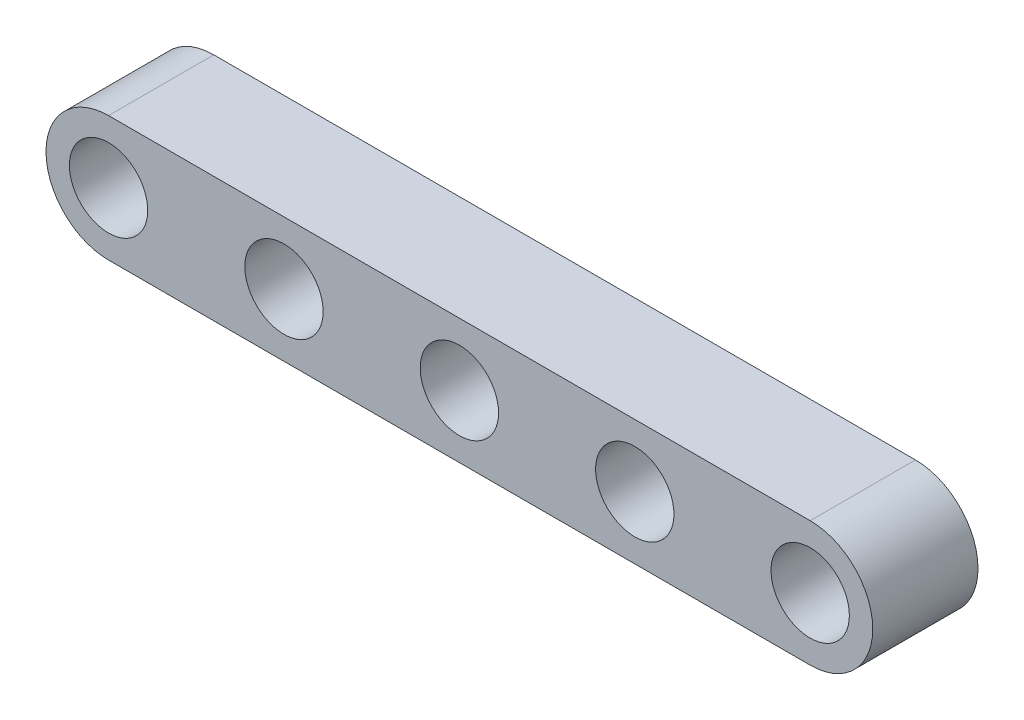
ISO-10303-21;
HEADER;
FILE_DESCRIPTION(('STEP AP214'),'2;1');
FILE_NAME('part.step','',(''),(''),'','','');
FILE_SCHEMA(('AUTOMOTIVE_DESIGN { 1 0 10303 214 1 1 1 1 }'));
ENDSEC;
DATA;
#1=APPLICATION_CONTEXT('core data for automotive mechanical design processes');
#2=APPLICATION_PROTOCOL_DEFINITION('international standard','automotive_design',2000,#1);
#3=PRODUCT_CONTEXT('',#1,'mechanical');
#4=PRODUCT('Part','Part','',(#3));
#5=PRODUCT_RELATED_PRODUCT_CATEGORY('part','',(#4));
#6=PRODUCT_DEFINITION_FORMATION('','',#4);
#7=PRODUCT_DEFINITION_CONTEXT('part definition',#1,'design');
#8=PRODUCT_DEFINITION('design','',#6,#7);
#9=PRODUCT_DEFINITION_SHAPE('','',#8);
#10=(LENGTH_UNIT() NAMED_UNIT(*) SI_UNIT(.MILLI.,.METRE.));
#11=(NAMED_UNIT(*) PLANE_ANGLE_UNIT() SI_UNIT($,.RADIAN.));
#12=(NAMED_UNIT(*) SI_UNIT($,.STERADIAN.) SOLID_ANGLE_UNIT());
#13=UNCERTAINTY_MEASURE_WITH_UNIT(LENGTH_MEASURE(1.E-05),#10,'distance_accuracy_value','');
#14=(GEOMETRIC_REPRESENTATION_CONTEXT(3) GLOBAL_UNCERTAINTY_ASSIGNED_CONTEXT((#13)) GLOBAL_UNIT_ASSIGNED_CONTEXT((#10,
#11,#12)) REPRESENTATION_CONTEXT('',''));
#15=CARTESIAN_POINT('',(0.,0.,0.));
#16=DIRECTION('',(0.,0.,1.));
#17=DIRECTION('',(1.,0.,0.));
#18=AXIS2_PLACEMENT_3D('',#15,#16,#17);
#19=CARTESIAN_POINT('',(-15.,0.,2.25));
#20=DIRECTION('',(0.,0.,1.));
#21=DIRECTION('',(1.,0.,0.));
#22=AXIS2_PLACEMENT_3D('',#19,#20,#21);
#23=PLANE('',#22);
#24=CARTESIAN_POINT('',(7.5,0.,2.25));
#25=DIRECTION('',(0.,0.,1.));
#26=DIRECTION('',(1.,0.,0.));
#27=AXIS2_PLACEMENT_3D('',#24,#25,#26);
#28=CIRCLE('',#27,1.675);
#29=CARTESIAN_POINT('',(9.175,0.,2.25));
#30=VERTEX_POINT('',#29);
#31=EDGE_CURVE('E150',#30,#30,#28,.T.);
#32=ORIENTED_EDGE('',*,*,#31,.F.);
#33=EDGE_LOOP('',(#32));
#34=FACE_BOUND('',#33,.T.);
#35=CARTESIAN_POINT('',(-7.5,0.,2.25));
#36=DIRECTION('',(0.,0.,1.));
#37=DIRECTION('',(1.,0.,0.));
#38=AXIS2_PLACEMENT_3D('',#35,#36,#37);
#39=CIRCLE('',#38,1.675);
#40=CARTESIAN_POINT('',(-5.825,0.,2.25));
#41=VERTEX_POINT('',#40);
#42=EDGE_CURVE('E134',#41,#41,#39,.T.);
#43=ORIENTED_EDGE('',*,*,#42,.F.);
#44=EDGE_LOOP('',(#43));
#45=FACE_BOUND('',#44,.T.);
#46=CARTESIAN_POINT('',(-15.,0.,2.25));
#47=DIRECTION('',(0.,0.,1.));
#48=DIRECTION('',(1.,0.,0.));
#49=AXIS2_PLACEMENT_3D('',#46,#47,#48);
#50=CIRCLE('',#49,2.675);
#51=CARTESIAN_POINT('',(-15.,2.675,2.25));
#52=VERTEX_POINT('',#51);
#53=CARTESIAN_POINT('',(-15.,-2.675,2.25));
#54=VERTEX_POINT('',#53);
#55=EDGE_CURVE('E92',#52,#54,#50,.T.);
#56=ORIENTED_EDGE('',*,*,#55,.T.);
#57=DIRECTION('',(1.,0.,0.));
#58=VECTOR('',#57,1.);
#59=CARTESIAN_POINT('',(-15.,-2.675,2.25));
#60=LINE('',#59,#58);
#61=CARTESIAN_POINT('',(15.,-2.675,2.25));
#62=VERTEX_POINT('',#61);
#63=EDGE_CURVE('E87',#54,#62,#60,.T.);
#64=ORIENTED_EDGE('',*,*,#63,.T.);
#65=CARTESIAN_POINT('',(15.,0.,2.25));
#66=DIRECTION('',(0.,0.,1.));
#67=DIRECTION('',(1.,0.,0.));
#68=AXIS2_PLACEMENT_3D('',#65,#66,#67);
#69=CIRCLE('',#68,2.675);
#70=CARTESIAN_POINT('',(15.,2.675,2.25));
#71=VERTEX_POINT('',#70);
#72=EDGE_CURVE('E90',#62,#71,#69,.T.);
#73=ORIENTED_EDGE('',*,*,#72,.T.);
#74=DIRECTION('',(-1.,0.,0.));
#75=VECTOR('',#74,1.);
#76=CARTESIAN_POINT('',(-15.,2.675,2.25));
#77=LINE('',#76,#75);
#78=EDGE_CURVE('E57',#71,#52,#77,.T.);
#79=ORIENTED_EDGE('',*,*,#78,.T.);
#80=EDGE_LOOP('',(#56,#64,#73,#79));
#81=FACE_BOUND('',#80,.T.);
#82=CARTESIAN_POINT('',(-15.,0.,2.25));
#83=DIRECTION('',(0.,0.,1.));
#84=DIRECTION('',(1.,0.,0.));
#85=AXIS2_PLACEMENT_3D('',#82,#83,#84);
#86=CIRCLE('',#85,1.675);
#87=CARTESIAN_POINT('',(-13.325,0.,2.25));
#88=VERTEX_POINT('',#87);
#89=EDGE_CURVE('E112',#88,#88,#86,.T.);
#90=ORIENTED_EDGE('',*,*,#89,.F.);
#91=EDGE_LOOP('',(#90));
#92=FACE_BOUND('',#91,.T.);
#93=CARTESIAN_POINT('',(0.,0.,2.25));
#94=DIRECTION('',(0.,0.,1.));
#95=DIRECTION('',(1.,0.,0.));
#96=AXIS2_PLACEMENT_3D('',#93,#94,#95);
#97=CIRCLE('',#96,1.675);
#98=CARTESIAN_POINT('',(1.675,0.,2.25));
#99=VERTEX_POINT('',#98);
#100=EDGE_CURVE('E142',#99,#99,#97,.T.);
#101=ORIENTED_EDGE('',*,*,#100,.F.);
#102=EDGE_LOOP('',(#101));
#103=FACE_BOUND('',#102,.T.);
#104=CARTESIAN_POINT('',(15.,0.,2.25));
#105=DIRECTION('',(0.,0.,1.));
#106=DIRECTION('',(1.,0.,0.));
#107=AXIS2_PLACEMENT_3D('',#104,#105,#106);
#108=CIRCLE('',#107,1.675);
#109=CARTESIAN_POINT('',(16.675,0.,2.25));
#110=VERTEX_POINT('',#109);
#111=EDGE_CURVE('E158',#110,#110,#108,.T.);
#112=ORIENTED_EDGE('',*,*,#111,.F.);
#113=EDGE_LOOP('',(#112));
#114=FACE_BOUND('',#113,.T.);
#115=ADVANCED_FACE('F39',(#34,#45,#81,#92,#103,#114),#23,.T.);
#116=CARTESIAN_POINT('',(-15.,0.,-2.25));
#117=DIRECTION('',(0.,0.,1.));
#118=DIRECTION('',(1.,0.,0.));
#119=AXIS2_PLACEMENT_3D('',#116,#117,#118);
#120=PLANE('',#119);
#121=CARTESIAN_POINT('',(-15.,0.,-2.25));
#122=DIRECTION('',(0.,0.,1.));
#123=DIRECTION('',(1.,0.,0.));
#124=AXIS2_PLACEMENT_3D('',#121,#122,#123);
#125=CIRCLE('',#124,2.675);
#126=CARTESIAN_POINT('',(-15.,2.675,-2.25));
#127=VERTEX_POINT('',#126);
#128=CARTESIAN_POINT('',(-15.,-2.675,-2.25));
#129=VERTEX_POINT('',#128);
#130=EDGE_CURVE('E108',#127,#129,#125,.T.);
#131=ORIENTED_EDGE('',*,*,#130,.F.);
#132=DIRECTION('',(-1.,0.,0.));
#133=VECTOR('',#132,1.);
#134=CARTESIAN_POINT('',(-15.,2.675,-2.25));
#135=LINE('',#134,#133);
#136=CARTESIAN_POINT('',(15.,2.675,-2.25));
#137=VERTEX_POINT('',#136);
#138=EDGE_CURVE('E80',#137,#127,#135,.T.);
#139=ORIENTED_EDGE('',*,*,#138,.F.);
#140=CARTESIAN_POINT('',(15.,0.,-2.25));
#141=DIRECTION('',(0.,0.,1.));
#142=DIRECTION('',(1.,0.,0.));
#143=AXIS2_PLACEMENT_3D('',#140,#141,#142);
#144=CIRCLE('',#143,2.675);
#145=CARTESIAN_POINT('',(15.,-2.675,-2.25));
#146=VERTEX_POINT('',#145);
#147=EDGE_CURVE('E74',#146,#137,#144,.T.);
#148=ORIENTED_EDGE('',*,*,#147,.F.);
#149=DIRECTION('',(1.,0.,0.));
#150=VECTOR('',#149,1.);
#151=CARTESIAN_POINT('',(-15.,-2.675,-2.25));
#152=LINE('',#151,#150);
#153=EDGE_CURVE('E97',#129,#146,#152,.T.);
#154=ORIENTED_EDGE('',*,*,#153,.F.);
#155=EDGE_LOOP('',(#131,#139,#148,#154));
#156=FACE_BOUND('',#155,.T.);
#157=CARTESIAN_POINT('',(-15.,0.,-2.25));
#158=DIRECTION('',(0.,0.,1.));
#159=DIRECTION('',(1.,0.,0.));
#160=AXIS2_PLACEMENT_3D('',#157,#158,#159);
#161=CIRCLE('',#160,1.675);
#162=CARTESIAN_POINT('',(-13.325,0.,-2.25));
#163=VERTEX_POINT('',#162);
#164=EDGE_CURVE('E130',#163,#163,#161,.T.);
#165=ORIENTED_EDGE('',*,*,#164,.T.);
#166=EDGE_LOOP('',(#165));
#167=FACE_BOUND('',#166,.T.);
#168=CARTESIAN_POINT('',(-7.5,0.,-2.25));
#169=DIRECTION('',(0.,0.,1.));
#170=DIRECTION('',(1.,0.,0.));
#171=AXIS2_PLACEMENT_3D('',#168,#169,#170);
#172=CIRCLE('',#171,1.675);
#173=CARTESIAN_POINT('',(-5.825,0.,-2.25));
#174=VERTEX_POINT('',#173);
#175=EDGE_CURVE('E138',#174,#174,#172,.T.);
#176=ORIENTED_EDGE('',*,*,#175,.T.);
#177=EDGE_LOOP('',(#176));
#178=FACE_BOUND('',#177,.T.);
#179=CARTESIAN_POINT('',(0.,0.,-2.25));
#180=DIRECTION('',(0.,0.,1.));
#181=DIRECTION('',(1.,0.,0.));
#182=AXIS2_PLACEMENT_3D('',#179,#180,#181);
#183=CIRCLE('',#182,1.675);
#184=CARTESIAN_POINT('',(1.675,0.,-2.25));
#185=VERTEX_POINT('',#184);
#186=EDGE_CURVE('E146',#185,#185,#183,.T.);
#187=ORIENTED_EDGE('',*,*,#186,.T.);
#188=EDGE_LOOP('',(#187));
#189=FACE_BOUND('',#188,.T.);
#190=CARTESIAN_POINT('',(7.5,0.,-2.25));
#191=DIRECTION('',(0.,0.,1.));
#192=DIRECTION('',(1.,0.,0.));
#193=AXIS2_PLACEMENT_3D('',#190,#191,#192);
#194=CIRCLE('',#193,1.675);
#195=CARTESIAN_POINT('',(9.175,0.,-2.25));
#196=VERTEX_POINT('',#195);
#197=EDGE_CURVE('E154',#196,#196,#194,.T.);
#198=ORIENTED_EDGE('',*,*,#197,.T.);
#199=EDGE_LOOP('',(#198));
#200=FACE_BOUND('',#199,.T.);
#201=CARTESIAN_POINT('',(15.,0.,-2.25));
#202=DIRECTION('',(0.,0.,1.));
#203=DIRECTION('',(1.,0.,0.));
#204=AXIS2_PLACEMENT_3D('',#201,#202,#203);
#205=CIRCLE('',#204,1.675);
#206=CARTESIAN_POINT('',(16.675,0.,-2.25));
#207=VERTEX_POINT('',#206);
#208=EDGE_CURVE('E162',#207,#207,#205,.T.);
#209=ORIENTED_EDGE('',*,*,#208,.T.);
#210=EDGE_LOOP('',(#209));
#211=FACE_BOUND('',#210,.T.);
#212=ADVANCED_FACE('F125',(#156,#167,#178,#189,#200,#211),#120,.F.);
#213=CARTESIAN_POINT('',(-15.,0.,2.25));
#214=DIRECTION('',(0.,0.,-1.));
#215=DIRECTION('',(-1.,0.,0.));
#216=AXIS2_PLACEMENT_3D('',#213,#214,#215);
#217=CYLINDRICAL_SURFACE('',#216,2.675);
#218=ORIENTED_EDGE('',*,*,#130,.T.);
#219=DIRECTION('',(0.,0.,-1.));
#220=VECTOR('',#219,1.);
#221=CARTESIAN_POINT('',(-15.,-2.675,2.25));
#222=LINE('',#221,#220);
#223=EDGE_CURVE('E11',#54,#129,#222,.T.);
#224=ORIENTED_EDGE('',*,*,#223,.F.);
#225=ORIENTED_EDGE('',*,*,#55,.F.);
#226=DIRECTION('',(0.,0.,-1.));
#227=VECTOR('',#226,1.);
#228=CARTESIAN_POINT('',(-15.,2.675,2.25));
#229=LINE('',#228,#227);
#230=EDGE_CURVE('E104',#52,#127,#229,.T.);
#231=ORIENTED_EDGE('',*,*,#230,.T.);
#232=EDGE_LOOP('',(#218,#224,#225,#231));
#233=FACE_BOUND('',#232,.T.);
#234=ADVANCED_FACE('F41',(#233),#217,.T.);
#235=CARTESIAN_POINT('',(-15.,-2.675,2.25));
#236=DIRECTION('',(0.,1.,0.));
#237=DIRECTION('',(0.,0.,1.));
#238=AXIS2_PLACEMENT_3D('',#235,#236,#237);
#239=PLANE('',#238);
#240=ORIENTED_EDGE('',*,*,#153,.T.);
#241=DIRECTION('',(0.,0.,-1.));
#242=VECTOR('',#241,1.);
#243=CARTESIAN_POINT('',(15.,-2.675,2.25));
#244=LINE('',#243,#242);
#245=EDGE_CURVE('E49',#62,#146,#244,.T.);
#246=ORIENTED_EDGE('',*,*,#245,.F.);
#247=ORIENTED_EDGE('',*,*,#63,.F.);
#248=ORIENTED_EDGE('',*,*,#223,.T.);
#249=EDGE_LOOP('',(#240,#246,#247,#248));
#250=FACE_BOUND('',#249,.T.);
#251=ADVANCED_FACE('F96',(#250),#239,.F.);
#252=CARTESIAN_POINT('',(15.,0.,2.25));
#253=DIRECTION('',(0.,0.,-1.));
#254=DIRECTION('',(-1.,0.,0.));
#255=AXIS2_PLACEMENT_3D('',#252,#253,#254);
#256=CYLINDRICAL_SURFACE('',#255,2.675);
#257=ORIENTED_EDGE('',*,*,#147,.T.);
#258=DIRECTION('',(0.,0.,-1.));
#259=VECTOR('',#258,1.);
#260=CARTESIAN_POINT('',(15.,2.675,2.25));
#261=LINE('',#260,#259);
#262=EDGE_CURVE('E99',#71,#137,#261,.T.);
#263=ORIENTED_EDGE('',*,*,#262,.F.);
#264=ORIENTED_EDGE('',*,*,#72,.F.);
#265=ORIENTED_EDGE('',*,*,#245,.T.);
#266=EDGE_LOOP('',(#257,#263,#264,#265));
#267=FACE_BOUND('',#266,.T.);
#268=ADVANCED_FACE('F100',(#267),#256,.T.);
#269=CARTESIAN_POINT('',(-15.,2.675,2.25));
#270=DIRECTION('',(0.,-1.,0.));
#271=DIRECTION('',(0.,0.,-1.));
#272=AXIS2_PLACEMENT_3D('',#269,#270,#271);
#273=PLANE('',#272);
#274=ORIENTED_EDGE('',*,*,#138,.T.);
#275=ORIENTED_EDGE('',*,*,#230,.F.);
#276=ORIENTED_EDGE('',*,*,#78,.F.);
#277=ORIENTED_EDGE('',*,*,#262,.T.);
#278=EDGE_LOOP('',(#274,#275,#276,#277));
#279=FACE_BOUND('',#278,.T.);
#280=ADVANCED_FACE('F122',(#279),#273,.F.);
#281=CARTESIAN_POINT('',(-15.,0.,2.25));
#282=DIRECTION('',(0.,0.,-1.));
#283=DIRECTION('',(-1.,0.,0.));
#284=AXIS2_PLACEMENT_3D('',#281,#282,#283);
#285=CYLINDRICAL_SURFACE('',#284,1.675);
#286=ORIENTED_EDGE('',*,*,#89,.T.);
#287=EDGE_LOOP('',(#286));
#288=FACE_BOUND('',#287,.T.);
#289=ORIENTED_EDGE('',*,*,#164,.F.);
#290=EDGE_LOOP('',(#289));
#291=FACE_BOUND('',#290,.T.);
#292=ADVANCED_FACE('F183',(#288,#291),#285,.F.);
#293=CARTESIAN_POINT('',(-7.5,0.,2.25));
#294=DIRECTION('',(0.,0.,-1.));
#295=DIRECTION('',(-1.,0.,0.));
#296=AXIS2_PLACEMENT_3D('',#293,#294,#295);
#297=CYLINDRICAL_SURFACE('',#296,1.675);
#298=ORIENTED_EDGE('',*,*,#42,.T.);
#299=EDGE_LOOP('',(#298));
#300=FACE_BOUND('',#299,.T.);
#301=ORIENTED_EDGE('',*,*,#175,.F.);
#302=EDGE_LOOP('',(#301));
#303=FACE_BOUND('',#302,.T.);
#304=ADVANCED_FACE('F229',(#300,#303),#297,.F.);
#305=CARTESIAN_POINT('',(0.,0.,2.25));
#306=DIRECTION('',(0.,0.,-1.));
#307=DIRECTION('',(-1.,0.,0.));
#308=AXIS2_PLACEMENT_3D('',#305,#306,#307);
#309=CYLINDRICAL_SURFACE('',#308,1.675);
#310=ORIENTED_EDGE('',*,*,#100,.T.);
#311=EDGE_LOOP('',(#310));
#312=FACE_BOUND('',#311,.T.);
#313=ORIENTED_EDGE('',*,*,#186,.F.);
#314=EDGE_LOOP('',(#313));
#315=FACE_BOUND('',#314,.T.);
#316=ADVANCED_FACE('F237',(#312,#315),#309,.F.);
#317=CARTESIAN_POINT('',(7.5,0.,2.25));
#318=DIRECTION('',(0.,0.,-1.));
#319=DIRECTION('',(-1.,0.,0.));
#320=AXIS2_PLACEMENT_3D('',#317,#318,#319);
#321=CYLINDRICAL_SURFACE('',#320,1.675);
#322=ORIENTED_EDGE('',*,*,#31,.T.);
#323=EDGE_LOOP('',(#322));
#324=FACE_BOUND('',#323,.T.);
#325=ORIENTED_EDGE('',*,*,#197,.F.);
#326=EDGE_LOOP('',(#325));
#327=FACE_BOUND('',#326,.T.);
#328=ADVANCED_FACE('F245',(#324,#327),#321,.F.);
#329=CARTESIAN_POINT('',(15.,0.,2.25));
#330=DIRECTION('',(0.,0.,-1.));
#331=DIRECTION('',(-1.,0.,0.));
#332=AXIS2_PLACEMENT_3D('',#329,#330,#331);
#333=CYLINDRICAL_SURFACE('',#332,1.675);
#334=ORIENTED_EDGE('',*,*,#111,.T.);
#335=EDGE_LOOP('',(#334));
#336=FACE_BOUND('',#335,.T.);
#337=ORIENTED_EDGE('',*,*,#208,.F.);
#338=EDGE_LOOP('',(#337));
#339=FACE_BOUND('',#338,.T.);
#340=ADVANCED_FACE('F170',(#336,#339),#333,.F.);
#341=CLOSED_SHELL('',(#115,#212,#234,#251,#268,#280,#292,#304,#316,#328,#340));
#342=MANIFOLD_SOLID_BREP('B2',#341);
#343=ADVANCED_BREP_SHAPE_REPRESENTATION('',(#18,#342),#14);
#344=SHAPE_DEFINITION_REPRESENTATION(#9,#343);
ENDSEC;
END-ISO-10303-21;
